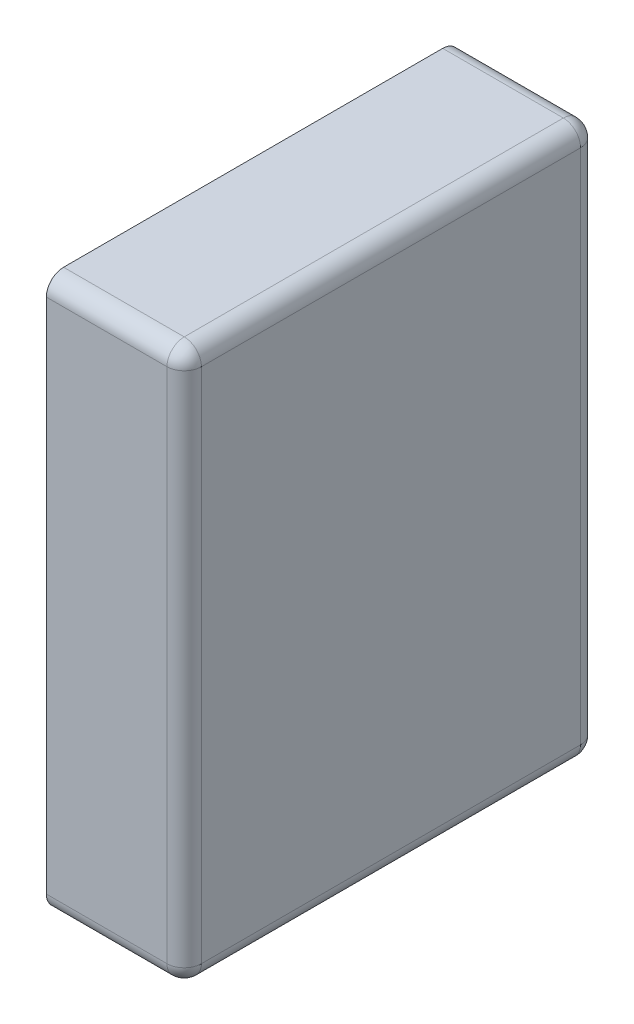
ISO-10303-21;
HEADER;
FILE_DESCRIPTION(('STEP AP214'),'2;1');
FILE_NAME('part.step','',(''),(''),'','','');
FILE_SCHEMA(('AUTOMOTIVE_DESIGN { 1 0 10303 214 1 1 1 1 }'));
ENDSEC;
DATA;
#1=APPLICATION_CONTEXT('core data for automotive mechanical design processes');
#2=APPLICATION_PROTOCOL_DEFINITION('international standard','automotive_design',2000,#1);
#3=PRODUCT_CONTEXT('',#1,'mechanical');
#4=PRODUCT('Part','Part','',(#3));
#5=PRODUCT_RELATED_PRODUCT_CATEGORY('part','',(#4));
#6=PRODUCT_DEFINITION_FORMATION('','',#4);
#7=PRODUCT_DEFINITION_CONTEXT('part definition',#1,'design');
#8=PRODUCT_DEFINITION('design','',#6,#7);
#9=PRODUCT_DEFINITION_SHAPE('','',#8);
#10=(LENGTH_UNIT() NAMED_UNIT(*) SI_UNIT(.MILLI.,.METRE.));
#11=(NAMED_UNIT(*) PLANE_ANGLE_UNIT() SI_UNIT($,.RADIAN.));
#12=(NAMED_UNIT(*) SI_UNIT($,.STERADIAN.) SOLID_ANGLE_UNIT());
#13=UNCERTAINTY_MEASURE_WITH_UNIT(LENGTH_MEASURE(1.E-05),#10,'distance_accuracy_value','');
#14=(GEOMETRIC_REPRESENTATION_CONTEXT(3) GLOBAL_UNCERTAINTY_ASSIGNED_CONTEXT((#13)) GLOBAL_UNIT_ASSIGNED_CONTEXT((#10,
#11,#12)) REPRESENTATION_CONTEXT('',''));
#15=CARTESIAN_POINT('',(0.,0.,0.));
#16=DIRECTION('',(0.,0.,1.));
#17=DIRECTION('',(1.,0.,0.));
#18=AXIS2_PLACEMENT_3D('',#15,#16,#17);
#19=CARTESIAN_POINT('',(0.8,-0.4,0.3));
#20=DIRECTION('',(-1.,0.,0.));
#21=DIRECTION('',(0.,0.,1.));
#22=AXIS2_PLACEMENT_3D('',#19,#20,#21);
#23=PLANE('',#22);
#24=DIRECTION('',(0.,0.,-1.));
#25=VECTOR('',#24,1.);
#26=CARTESIAN_POINT('',(0.8,-0.375,0.3));
#27=LINE('',#26,#25);
#28=CARTESIAN_POINT('',(0.8,-0.375,0.025));
#29=VERTEX_POINT('',#28);
#30=CARTESIAN_POINT('',(0.8,-0.375,0.575));
#31=VERTEX_POINT('',#30);
#32=EDGE_CURVE('E116',#29,#31,#27,.F.);
#33=ORIENTED_EDGE('',*,*,#32,.F.);
#34=DIRECTION('',(0.,-1.,0.));
#35=VECTOR('',#34,1.);
#36=CARTESIAN_POINT('',(0.8,-0.4,0.025));
#37=LINE('',#36,#35);
#38=CARTESIAN_POINT('',(0.8,0.375,0.025));
#39=VERTEX_POINT('',#38);
#40=EDGE_CURVE('E113',#39,#29,#37,.T.);
#41=ORIENTED_EDGE('',*,*,#40,.F.);
#42=DIRECTION('',(0.,0.,1.));
#43=VECTOR('',#42,1.);
#44=CARTESIAN_POINT('',(0.8,0.375,0.3));
#45=LINE('',#44,#43);
#46=CARTESIAN_POINT('',(0.8,0.375,0.575));
#47=VERTEX_POINT('',#46);
#48=EDGE_CURVE('E101',#47,#39,#45,.F.);
#49=ORIENTED_EDGE('',*,*,#48,.F.);
#50=DIRECTION('',(0.,-1.,0.));
#51=VECTOR('',#50,1.);
#52=CARTESIAN_POINT('',(0.8,-0.4,0.575));
#53=LINE('',#52,#51);
#54=EDGE_CURVE('E152',#31,#47,#53,.F.);
#55=ORIENTED_EDGE('',*,*,#54,.F.);
#56=EDGE_LOOP('',(#33,#41,#49,#55));
#57=FACE_BOUND('',#56,.T.);
#58=ADVANCED_FACE('F17',(#57),#23,.F.);
#59=CARTESIAN_POINT('',(0.775,0.375,0.025));
#60=DIRECTION('',(1.,0.,0.));
#61=DIRECTION('',(0.,1.,0.));
#62=AXIS2_PLACEMENT_3D('',#59,#60,#61);
#63=SPHERICAL_SURFACE('',#62,0.025);
#64=CARTESIAN_POINT('',(0.775,0.375,0.025));
#65=DIRECTION('',(1.,0.,0.));
#66=DIRECTION('',(0.,0.,-1.));
#67=AXIS2_PLACEMENT_3D('',#64,#65,#66);
#68=CIRCLE('',#67,0.025);
#69=CARTESIAN_POINT('',(0.775,0.4,0.025));
#70=VERTEX_POINT('',#69);
#71=CARTESIAN_POINT('',(0.775,0.375,0.));
#72=VERTEX_POINT('',#71);
#73=EDGE_CURVE('E118',#70,#72,#68,.F.);
#74=ORIENTED_EDGE('',*,*,#73,.F.);
#75=CARTESIAN_POINT('',(0.775,0.375,0.025));
#76=DIRECTION('',(0.,0.,1.));
#77=DIRECTION('',(1.,0.,0.));
#78=AXIS2_PLACEMENT_3D('',#75,#76,#77);
#79=CIRCLE('',#78,0.025);
#80=EDGE_CURVE('E106',#39,#70,#79,.T.);
#81=ORIENTED_EDGE('',*,*,#80,.F.);
#82=CARTESIAN_POINT('',(0.775,0.375,0.025));
#83=DIRECTION('',(0.,-1.,0.));
#84=DIRECTION('',(0.,0.,-1.));
#85=AXIS2_PLACEMENT_3D('',#82,#83,#84);
#86=CIRCLE('',#85,0.025);
#87=EDGE_CURVE('E119',#72,#39,#86,.T.);
#88=ORIENTED_EDGE('',*,*,#87,.F.);
#89=EDGE_LOOP('',(#74,#81,#88));
#90=FACE_BOUND('',#89,.T.);
#91=ADVANCED_FACE('F126',(#90),#63,.T.);
#92=CARTESIAN_POINT('',(0.775,0.375,0.3));
#93=DIRECTION('',(0.,0.,1.));
#94=DIRECTION('',(1.,0.,0.));
#95=AXIS2_PLACEMENT_3D('',#92,#93,#94);
#96=CYLINDRICAL_SURFACE('',#95,0.025);
#97=CARTESIAN_POINT('',(0.775,0.375,0.575));
#98=DIRECTION('',(0.,0.,1.));
#99=DIRECTION('',(1.,0.,0.));
#100=AXIS2_PLACEMENT_3D('',#97,#98,#99);
#101=CIRCLE('',#100,0.025);
#102=CARTESIAN_POINT('',(0.775,0.4,0.575));
#103=VERTEX_POINT('',#102);
#104=EDGE_CURVE('E108',#47,#103,#101,.T.);
#105=ORIENTED_EDGE('',*,*,#104,.F.);
#106=ORIENTED_EDGE('',*,*,#48,.T.);
#107=ORIENTED_EDGE('',*,*,#80,.T.);
#108=DIRECTION('',(0.,0.,-1.));
#109=VECTOR('',#108,1.);
#110=CARTESIAN_POINT('',(0.775,0.4,0.3));
#111=LINE('',#110,#109);
#112=EDGE_CURVE('E224',#70,#103,#111,.F.);
#113=ORIENTED_EDGE('',*,*,#112,.T.);
#114=EDGE_LOOP('',(#105,#106,#107,#113));
#115=FACE_BOUND('',#114,.T.);
#116=ADVANCED_FACE('F103',(#115),#96,.T.);
#117=CARTESIAN_POINT('',(0.775,0.375,0.575));
#118=DIRECTION('',(1.,0.,0.));
#119=DIRECTION('',(0.,1.,0.));
#120=AXIS2_PLACEMENT_3D('',#117,#118,#119);
#121=SPHERICAL_SURFACE('',#120,0.025);
#122=CARTESIAN_POINT('',(0.775,0.375,0.575));
#123=DIRECTION('',(-1.,0.,0.));
#124=DIRECTION('',(0.,0.,1.));
#125=AXIS2_PLACEMENT_3D('',#122,#123,#124);
#126=CIRCLE('',#125,0.025);
#127=CARTESIAN_POINT('',(0.775,0.375,0.6));
#128=VERTEX_POINT('',#127);
#129=EDGE_CURVE('E218',#128,#103,#126,.T.);
#130=ORIENTED_EDGE('',*,*,#129,.F.);
#131=CARTESIAN_POINT('',(0.775,0.375,0.575));
#132=DIRECTION('',(0.,-1.,0.));
#133=DIRECTION('',(0.,0.,-1.));
#134=AXIS2_PLACEMENT_3D('',#131,#132,#133);
#135=CIRCLE('',#134,0.025);
#136=EDGE_CURVE('E155',#47,#128,#135,.T.);
#137=ORIENTED_EDGE('',*,*,#136,.F.);
#138=ORIENTED_EDGE('',*,*,#104,.T.);
#139=EDGE_LOOP('',(#130,#137,#138));
#140=FACE_BOUND('',#139,.T.);
#141=ADVANCED_FACE('F141',(#140),#121,.T.);
#142=CARTESIAN_POINT('',(0.775,-0.4,0.575));
#143=DIRECTION('',(0.,-1.,0.));
#144=DIRECTION('',(0.,0.,-1.));
#145=AXIS2_PLACEMENT_3D('',#142,#143,#144);
#146=CYLINDRICAL_SURFACE('',#145,0.025);
#147=ORIENTED_EDGE('',*,*,#136,.T.);
#148=DIRECTION('',(0.,1.,0.));
#149=VECTOR('',#148,1.);
#150=CARTESIAN_POINT('',(0.775,-0.4,0.6));
#151=LINE('',#150,#149);
#152=CARTESIAN_POINT('',(0.775,-0.375,0.6));
#153=VERTEX_POINT('',#152);
#154=EDGE_CURVE('E213',#128,#153,#151,.F.);
#155=ORIENTED_EDGE('',*,*,#154,.T.);
#156=CARTESIAN_POINT('',(0.775,-0.375,0.575));
#157=DIRECTION('',(0.,-1.,0.));
#158=DIRECTION('',(1.,0.,0.));
#159=AXIS2_PLACEMENT_3D('',#156,#157,#158);
#160=CIRCLE('',#159,0.025);
#161=EDGE_CURVE('E159',#31,#153,#160,.T.);
#162=ORIENTED_EDGE('',*,*,#161,.F.);
#163=ORIENTED_EDGE('',*,*,#54,.T.);
#164=EDGE_LOOP('',(#147,#155,#162,#163));
#165=FACE_BOUND('',#164,.T.);
#166=ADVANCED_FACE('F145',(#165),#146,.T.);
#167=CARTESIAN_POINT('',(0.775,-0.375,0.575));
#168=DIRECTION('',(1.,0.,0.));
#169=DIRECTION('',(0.,1.,0.));
#170=AXIS2_PLACEMENT_3D('',#167,#168,#169);
#171=SPHERICAL_SURFACE('',#170,0.025);
#172=CARTESIAN_POINT('',(0.775,-0.375,0.575));
#173=DIRECTION('',(0.,0.,-1.));
#174=DIRECTION('',(-1.,0.,0.));
#175=AXIS2_PLACEMENT_3D('',#172,#173,#174);
#176=CIRCLE('',#175,0.025);
#177=CARTESIAN_POINT('',(0.775,-0.4,0.575));
#178=VERTEX_POINT('',#177);
#179=EDGE_CURVE('E293',#31,#178,#176,.T.);
#180=ORIENTED_EDGE('',*,*,#179,.F.);
#181=ORIENTED_EDGE('',*,*,#161,.T.);
#182=CARTESIAN_POINT('',(0.775,-0.375,0.575));
#183=DIRECTION('',(1.,0.,0.));
#184=DIRECTION('',(0.,0.,-1.));
#185=AXIS2_PLACEMENT_3D('',#182,#183,#184);
#186=CIRCLE('',#185,0.025);
#187=EDGE_CURVE('E208',#178,#153,#186,.F.);
#188=ORIENTED_EDGE('',*,*,#187,.F.);
#189=EDGE_LOOP('',(#180,#181,#188));
#190=FACE_BOUND('',#189,.T.);
#191=ADVANCED_FACE('F259',(#190),#171,.T.);
#192=CARTESIAN_POINT('',(0.775,-0.375,0.3));
#193=DIRECTION('',(0.,0.,-1.));
#194=DIRECTION('',(-1.,0.,0.));
#195=AXIS2_PLACEMENT_3D('',#192,#193,#194);
#196=CYLINDRICAL_SURFACE('',#195,0.025);
#197=ORIENTED_EDGE('',*,*,#179,.T.);
#198=DIRECTION('',(0.,0.,-1.));
#199=VECTOR('',#198,1.);
#200=CARTESIAN_POINT('',(0.775,-0.4,0.3));
#201=LINE('',#200,#199);
#202=CARTESIAN_POINT('',(0.775,-0.4,0.024999999999998));
#203=VERTEX_POINT('',#202);
#204=EDGE_CURVE('E203',#203,#178,#201,.F.);
#205=ORIENTED_EDGE('',*,*,#204,.F.);
#206=CARTESIAN_POINT('',(0.775,-0.375,0.025));
#207=DIRECTION('',(0.,3.1917767720228E-13,-1.));
#208=DIRECTION('',(1.,0.,0.));
#209=AXIS2_PLACEMENT_3D('',#206,#207,#208);
#210=CIRCLE('',#209,0.025);
#211=EDGE_CURVE('E235',#29,#203,#210,.T.);
#212=ORIENTED_EDGE('',*,*,#211,.F.);
#213=ORIENTED_EDGE('',*,*,#32,.T.);
#214=EDGE_LOOP('',(#197,#205,#212,#213));
#215=FACE_BOUND('',#214,.T.);
#216=ADVANCED_FACE('F255',(#215),#196,.T.);
#217=CARTESIAN_POINT('',(0.775,-0.375,0.025));
#218=DIRECTION('',(1.,0.,0.));
#219=DIRECTION('',(0.,1.,0.));
#220=AXIS2_PLACEMENT_3D('',#217,#218,#219);
#221=SPHERICAL_SURFACE('',#220,0.025);
#222=CARTESIAN_POINT('',(0.775,-0.375,0.025));
#223=DIRECTION('',(0.,-1.,0.));
#224=DIRECTION('',(0.,0.,-1.));
#225=AXIS2_PLACEMENT_3D('',#222,#223,#224);
#226=CIRCLE('',#225,0.025);
#227=CARTESIAN_POINT('',(0.775,-0.375,0.));
#228=VERTEX_POINT('',#227);
#229=EDGE_CURVE('E66',#29,#228,#226,.F.);
#230=ORIENTED_EDGE('',*,*,#229,.F.);
#231=ORIENTED_EDGE('',*,*,#211,.T.);
#232=CARTESIAN_POINT('',(0.775,-0.375,0.025));
#233=DIRECTION('',(-1.,0.,0.));
#234=DIRECTION('',(0.,0.,1.));
#235=AXIS2_PLACEMENT_3D('',#232,#233,#234);
#236=CIRCLE('',#235,0.025);
#237=EDGE_CURVE('E198',#228,#203,#236,.T.);
#238=ORIENTED_EDGE('',*,*,#237,.F.);
#239=EDGE_LOOP('',(#230,#231,#238));
#240=FACE_BOUND('',#239,.T.);
#241=ADVANCED_FACE('F251',(#240),#221,.T.);
#242=CARTESIAN_POINT('',(0.775,-0.4,0.025));
#243=DIRECTION('',(0.,-1.,0.));
#244=DIRECTION('',(0.,0.,-1.));
#245=AXIS2_PLACEMENT_3D('',#242,#243,#244);
#246=CYLINDRICAL_SURFACE('',#245,0.025);
#247=ORIENTED_EDGE('',*,*,#87,.T.);
#248=ORIENTED_EDGE('',*,*,#40,.T.);
#249=ORIENTED_EDGE('',*,*,#229,.T.);
#250=DIRECTION('',(0.,1.,0.));
#251=VECTOR('',#250,1.);
#252=CARTESIAN_POINT('',(0.775,-0.4,0.));
#253=LINE('',#252,#251);
#254=EDGE_CURVE('E123',#228,#72,#253,.T.);
#255=ORIENTED_EDGE('',*,*,#254,.T.);
#256=EDGE_LOOP('',(#247,#248,#249,#255));
#257=FACE_BOUND('',#256,.T.);
#258=ADVANCED_FACE('F122',(#257),#246,.T.);
#259=CARTESIAN_POINT('',(0.4,0.375,0.025));
#260=DIRECTION('',(1.,0.,0.));
#261=DIRECTION('',(0.,0.,-1.));
#262=AXIS2_PLACEMENT_3D('',#259,#260,#261);
#263=CYLINDRICAL_SURFACE('',#262,0.025);
#264=ORIENTED_EDGE('',*,*,#73,.T.);
#265=DIRECTION('',(1.,0.,0.));
#266=VECTOR('',#265,1.);
#267=CARTESIAN_POINT('',(0.7,0.375,0.));
#268=LINE('',#267,#266);
#269=CARTESIAN_POINT('',(0.6,0.375,0.));
#270=VERTEX_POINT('',#269);
#271=EDGE_CURVE('E190',#72,#270,#268,.F.);
#272=ORIENTED_EDGE('',*,*,#271,.T.);
#273=CARTESIAN_POINT('',(0.6,0.375,0.025));
#274=DIRECTION('',(1.,0.,0.));
#275=DIRECTION('',(0.,0.,-1.));
#276=AXIS2_PLACEMENT_3D('',#273,#274,#275);
#277=CIRCLE('',#276,0.025);
#278=CARTESIAN_POINT('',(0.6,0.4,0.025));
#279=VERTEX_POINT('',#278);
#280=EDGE_CURVE('E20',#270,#279,#277,.T.);
#281=ORIENTED_EDGE('',*,*,#280,.T.);
#282=DIRECTION('',(1.,0.,0.));
#283=VECTOR('',#282,1.);
#284=CARTESIAN_POINT('',(0.4,0.4,0.025));
#285=LINE('',#284,#283);
#286=EDGE_CURVE('E221',#279,#70,#285,.T.);
#287=ORIENTED_EDGE('',*,*,#286,.T.);
#288=EDGE_LOOP('',(#264,#272,#281,#287));
#289=FACE_BOUND('',#288,.T.);
#290=ADVANCED_FACE('F313',(#289),#263,.T.);
#291=CARTESIAN_POINT('',(0.4,0.4,0.3));
#292=DIRECTION('',(0.,-1.,0.));
#293=DIRECTION('',(0.,0.,-1.));
#294=AXIS2_PLACEMENT_3D('',#291,#292,#293);
#295=PLANE('',#294);
#296=ORIENTED_EDGE('',*,*,#286,.F.);
#297=DIRECTION('',(0.,0.,-1.));
#298=VECTOR('',#297,1.);
#299=CARTESIAN_POINT('',(0.6,0.4,0.499600058));
#300=LINE('',#299,#298);
#301=CARTESIAN_POINT('',(0.6,0.4,0.575));
#302=VERTEX_POINT('',#301);
#303=EDGE_CURVE('E177',#279,#302,#300,.F.);
#304=ORIENTED_EDGE('',*,*,#303,.T.);
#305=DIRECTION('',(-1.,0.,0.));
#306=VECTOR('',#305,1.);
#307=CARTESIAN_POINT('',(0.4,0.4,0.575));
#308=LINE('',#307,#306);
#309=EDGE_CURVE('E214',#103,#302,#308,.T.);
#310=ORIENTED_EDGE('',*,*,#309,.F.);
#311=ORIENTED_EDGE('',*,*,#112,.F.);
#312=EDGE_LOOP('',(#296,#304,#310,#311));
#313=FACE_BOUND('',#312,.T.);
#314=ADVANCED_FACE('F276',(#313),#295,.F.);
#315=CARTESIAN_POINT('',(0.4,0.375,0.575));
#316=DIRECTION('',(-1.,0.,0.));
#317=DIRECTION('',(0.,0.,1.));
#318=AXIS2_PLACEMENT_3D('',#315,#316,#317);
#319=CYLINDRICAL_SURFACE('',#318,0.025);
#320=ORIENTED_EDGE('',*,*,#129,.T.);
#321=ORIENTED_EDGE('',*,*,#309,.T.);
#322=CARTESIAN_POINT('',(0.6,0.375,0.575));
#323=DIRECTION('',(-1.,0.,0.));
#324=DIRECTION('',(0.,0.,1.));
#325=AXIS2_PLACEMENT_3D('',#322,#323,#324);
#326=CIRCLE('',#325,0.025);
#327=CARTESIAN_POINT('',(0.6,0.375,0.6));
#328=VERTEX_POINT('',#327);
#329=EDGE_CURVE('E175',#302,#328,#326,.F.);
#330=ORIENTED_EDGE('',*,*,#329,.T.);
#331=DIRECTION('',(-1.,0.,0.));
#332=VECTOR('',#331,1.);
#333=CARTESIAN_POINT('',(0.7,0.375,0.6));
#334=LINE('',#333,#332);
#335=EDGE_CURVE('E211',#328,#128,#334,.F.);
#336=ORIENTED_EDGE('',*,*,#335,.T.);
#337=EDGE_LOOP('',(#320,#321,#330,#336));
#338=FACE_BOUND('',#337,.T.);
#339=ADVANCED_FACE('F277',(#338),#319,.T.);
#340=CARTESIAN_POINT('',(0.7,-0.4,0.6));
#341=DIRECTION('',(0.,0.,-1.));
#342=DIRECTION('',(-1.,0.,0.));
#343=AXIS2_PLACEMENT_3D('',#340,#341,#342);
#344=PLANE('',#343);
#345=DIRECTION('',(1.,0.,0.));
#346=VECTOR('',#345,1.);
#347=CARTESIAN_POINT('',(0.7,-0.375,0.6));
#348=LINE('',#347,#346);
#349=CARTESIAN_POINT('',(0.6,-0.375,0.6));
#350=VERTEX_POINT('',#349);
#351=EDGE_CURVE('E206',#153,#350,#348,.F.);
#352=ORIENTED_EDGE('',*,*,#351,.F.);
#353=ORIENTED_EDGE('',*,*,#154,.F.);
#354=ORIENTED_EDGE('',*,*,#335,.F.);
#355=DIRECTION('',(0.,1.,0.));
#356=VECTOR('',#355,1.);
#357=CARTESIAN_POINT('',(0.6,-0.4,0.6));
#358=LINE('',#357,#356);
#359=EDGE_CURVE('E174',#328,#350,#358,.F.);
#360=ORIENTED_EDGE('',*,*,#359,.T.);
#361=EDGE_LOOP('',(#352,#353,#354,#360));
#362=FACE_BOUND('',#361,.T.);
#363=ADVANCED_FACE('F285',(#362),#344,.F.);
#364=CARTESIAN_POINT('',(0.7,-0.375,0.575));
#365=DIRECTION('',(1.,0.,0.));
#366=DIRECTION('',(0.,0.,-1.));
#367=AXIS2_PLACEMENT_3D('',#364,#365,#366);
#368=CYLINDRICAL_SURFACE('',#367,0.025);
#369=ORIENTED_EDGE('',*,*,#187,.T.);
#370=ORIENTED_EDGE('',*,*,#351,.T.);
#371=CARTESIAN_POINT('',(0.6,-0.375,0.575));
#372=DIRECTION('',(1.,0.,0.));
#373=DIRECTION('',(0.,0.,-1.));
#374=AXIS2_PLACEMENT_3D('',#371,#372,#373);
#375=CIRCLE('',#374,0.025);
#376=CARTESIAN_POINT('',(0.6,-0.4,0.575));
#377=VERTEX_POINT('',#376);
#378=EDGE_CURVE('E172',#350,#377,#375,.T.);
#379=ORIENTED_EDGE('',*,*,#378,.T.);
#380=DIRECTION('',(1.,0.,0.));
#381=VECTOR('',#380,1.);
#382=CARTESIAN_POINT('',(0.4,-0.4,0.575));
#383=LINE('',#382,#381);
#384=EDGE_CURVE('E201',#178,#377,#383,.F.);
#385=ORIENTED_EDGE('',*,*,#384,.F.);
#386=EDGE_LOOP('',(#369,#370,#379,#385));
#387=FACE_BOUND('',#386,.T.);
#388=ADVANCED_FACE('F303',(#387),#368,.T.);
#389=CARTESIAN_POINT('',(0.4,-0.4,0.3));
#390=DIRECTION('',(0.,-1.,0.));
#391=DIRECTION('',(0.,0.,-1.));
#392=AXIS2_PLACEMENT_3D('',#389,#390,#391);
#393=PLANE('',#392);
#394=ORIENTED_EDGE('',*,*,#204,.T.);
#395=ORIENTED_EDGE('',*,*,#384,.T.);
#396=DIRECTION('',(0.,0.,-1.));
#397=VECTOR('',#396,1.);
#398=CARTESIAN_POINT('',(0.6,-0.4,0.499600058));
#399=LINE('',#398,#397);
#400=CARTESIAN_POINT('',(0.6,-0.4,0.025));
#401=VERTEX_POINT('',#400);
#402=EDGE_CURVE('E171',#377,#401,#399,.T.);
#403=ORIENTED_EDGE('',*,*,#402,.T.);
#404=DIRECTION('',(-1.,0.,0.));
#405=VECTOR('',#404,1.);
#406=CARTESIAN_POINT('',(0.7,-0.4,0.025));
#407=LINE('',#406,#405);
#408=EDGE_CURVE('E194',#203,#401,#407,.T.);
#409=ORIENTED_EDGE('',*,*,#408,.F.);
#410=EDGE_LOOP('',(#394,#395,#403,#409));
#411=FACE_BOUND('',#410,.T.);
#412=ADVANCED_FACE('F306',(#411),#393,.T.);
#413=CARTESIAN_POINT('',(0.7,-0.375,0.025));
#414=DIRECTION('',(-1.,0.,0.));
#415=DIRECTION('',(0.,0.,1.));
#416=AXIS2_PLACEMENT_3D('',#413,#414,#415);
#417=CYLINDRICAL_SURFACE('',#416,0.025);
#418=ORIENTED_EDGE('',*,*,#237,.T.);
#419=ORIENTED_EDGE('',*,*,#408,.T.);
#420=CARTESIAN_POINT('',(0.6,-0.375,0.025));
#421=DIRECTION('',(-1.,0.,0.));
#422=DIRECTION('',(0.,0.,1.));
#423=AXIS2_PLACEMENT_3D('',#420,#421,#422);
#424=CIRCLE('',#423,0.025);
#425=CARTESIAN_POINT('',(0.6,-0.375,0.));
#426=VERTEX_POINT('',#425);
#427=EDGE_CURVE('E26',#401,#426,#424,.F.);
#428=ORIENTED_EDGE('',*,*,#427,.T.);
#429=DIRECTION('',(1.,0.,0.));
#430=VECTOR('',#429,1.);
#431=CARTESIAN_POINT('',(0.7,-0.375,0.));
#432=LINE('',#431,#430);
#433=EDGE_CURVE('E34',#426,#228,#432,.T.);
#434=ORIENTED_EDGE('',*,*,#433,.T.);
#435=EDGE_LOOP('',(#418,#419,#428,#434));
#436=FACE_BOUND('',#435,.T.);
#437=ADVANCED_FACE('F309',(#436),#417,.T.);
#438=CARTESIAN_POINT('',(0.7,-0.4,0.));
#439=DIRECTION('',(0.,0.,1.));
#440=DIRECTION('',(1.,0.,0.));
#441=AXIS2_PLACEMENT_3D('',#438,#439,#440);
#442=PLANE('',#441);
#443=ORIENTED_EDGE('',*,*,#433,.F.);
#444=DIRECTION('',(0.,1.,0.));
#445=VECTOR('',#444,1.);
#446=CARTESIAN_POINT('',(0.6,-0.4,0.));
#447=LINE('',#446,#445);
#448=EDGE_CURVE('E11',#426,#270,#447,.T.);
#449=ORIENTED_EDGE('',*,*,#448,.T.);
#450=ORIENTED_EDGE('',*,*,#271,.F.);
#451=ORIENTED_EDGE('',*,*,#254,.F.);
#452=EDGE_LOOP('',(#443,#449,#450,#451));
#453=FACE_BOUND('',#452,.T.);
#454=ADVANCED_FACE('F311',(#453),#442,.F.);
#455=CARTESIAN_POINT('',(0.6,-0.4,0.499600058));
#456=DIRECTION('',(1.,0.,0.));
#457=DIRECTION('',(0.,0.,-1.));
#458=AXIS2_PLACEMENT_3D('',#455,#456,#457);
#459=PLANE('',#458);
#460=ORIENTED_EDGE('',*,*,#427,.F.);
#461=ORIENTED_EDGE('',*,*,#402,.F.);
#462=ORIENTED_EDGE('',*,*,#378,.F.);
#463=ORIENTED_EDGE('',*,*,#359,.F.);
#464=ORIENTED_EDGE('',*,*,#329,.F.);
#465=ORIENTED_EDGE('',*,*,#303,.F.);
#466=ORIENTED_EDGE('',*,*,#280,.F.);
#467=ORIENTED_EDGE('',*,*,#448,.F.);
#468=EDGE_LOOP('',(#460,#461,#462,#463,#464,#465,#466,#467));
#469=FACE_BOUND('',#468,.T.);
#470=ADVANCED_FACE('F280',(#469),#459,.F.);
#471=CLOSED_SHELL('',(#58,#91,#116,#141,#166,#191,#216,#241,#258,#290,#314,#339,#363,#388,#412,
#437,#454,#470));
#472=MANIFOLD_SOLID_BREP('B1',#471);
#473=ADVANCED_BREP_SHAPE_REPRESENTATION('',(#18,#472),#14);
#474=SHAPE_DEFINITION_REPRESENTATION(#9,#473);
ENDSEC;
END-ISO-10303-21;
